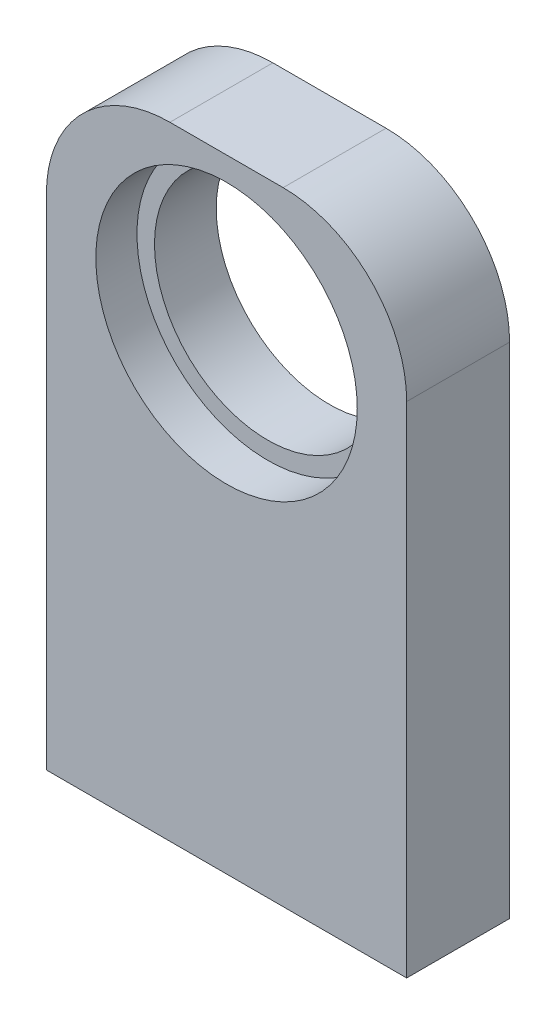
ISO-10303-21;
HEADER;
FILE_DESCRIPTION(('STEP AP214'),'2;1');
FILE_NAME('part.step','',(''),(''),'','','');
FILE_SCHEMA(('AUTOMOTIVE_DESIGN { 1 0 10303 214 1 1 1 1 }'));
ENDSEC;
DATA;
#1=APPLICATION_CONTEXT('core data for automotive mechanical design processes');
#2=APPLICATION_PROTOCOL_DEFINITION('international standard','automotive_design',2000,#1);
#3=PRODUCT_CONTEXT('',#1,'mechanical');
#4=PRODUCT('Part','Part','',(#3));
#5=PRODUCT_RELATED_PRODUCT_CATEGORY('part','',(#4));
#6=PRODUCT_DEFINITION_FORMATION('','',#4);
#7=PRODUCT_DEFINITION_CONTEXT('part definition',#1,'design');
#8=PRODUCT_DEFINITION('design','',#6,#7);
#9=PRODUCT_DEFINITION_SHAPE('','',#8);
#10=(LENGTH_UNIT() NAMED_UNIT(*) SI_UNIT(.MILLI.,.METRE.));
#11=(NAMED_UNIT(*) PLANE_ANGLE_UNIT() SI_UNIT($,.RADIAN.));
#12=(NAMED_UNIT(*) SI_UNIT($,.STERADIAN.) SOLID_ANGLE_UNIT());
#13=UNCERTAINTY_MEASURE_WITH_UNIT(LENGTH_MEASURE(1.E-05),#10,'distance_accuracy_value','');
#14=(GEOMETRIC_REPRESENTATION_CONTEXT(3) GLOBAL_UNCERTAINTY_ASSIGNED_CONTEXT((#13)) GLOBAL_UNIT_ASSIGNED_CONTEXT((#10,
#11,#12)) REPRESENTATION_CONTEXT('',''));
#15=CARTESIAN_POINT('',(0.,0.,0.));
#16=DIRECTION('',(0.,0.,1.));
#17=DIRECTION('',(1.,0.,0.));
#18=AXIS2_PLACEMENT_3D('',#15,#16,#17);
#19=CARTESIAN_POINT('',(1.16467585108376,45.5,-5.));
#20=DIRECTION('',(0.,0.,1.));
#21=DIRECTION('',(1.,0.,0.));
#22=AXIS2_PLACEMENT_3D('',#19,#20,#21);
#23=CYLINDRICAL_SURFACE('',#22,11.);
#24=CARTESIAN_POINT('',(1.16467585108376,45.5,-5.));
#25=DIRECTION('',(0.,0.,1.));
#26=DIRECTION('',(1.,0.,0.));
#27=AXIS2_PLACEMENT_3D('',#24,#25,#26);
#28=CIRCLE('',#27,11.);
#29=CARTESIAN_POINT('',(12.1646758510838,45.5,-5.));
#30=VERTEX_POINT('',#29);
#31=EDGE_CURVE('E108',#30,#30,#28,.T.);
#32=ORIENTED_EDGE('',*,*,#31,.F.);
#33=EDGE_LOOP('',(#32));
#34=FACE_BOUND('',#33,.T.);
#35=CARTESIAN_POINT('',(1.16467585108376,45.5,1.));
#36=DIRECTION('',(0.,0.,1.));
#37=DIRECTION('',(1.,0.,0.));
#38=AXIS2_PLACEMENT_3D('',#35,#36,#37);
#39=CIRCLE('',#38,11.);
#40=CARTESIAN_POINT('',(12.1646758510838,45.5,1.));
#41=VERTEX_POINT('',#40);
#42=EDGE_CURVE('E37',#41,#41,#39,.F.);
#43=ORIENTED_EDGE('',*,*,#42,.F.);
#44=EDGE_LOOP('',(#43));
#45=FACE_BOUND('',#44,.T.);
#46=ADVANCED_FACE('F33',(#34,#45),#23,.F.);
#47=CARTESIAN_POINT('',(-16.3353241489162,60.5,-5.));
#48=DIRECTION('',(1.,0.,0.));
#49=DIRECTION('',(0.,0.,-1.));
#50=AXIS2_PLACEMENT_3D('',#47,#48,#49);
#51=PLANE('',#50);
#52=DIRECTION('',(0.,-1.,0.));
#53=VECTOR('',#52,1.);
#54=CARTESIAN_POINT('',(-16.3353241489162,60.5,5.));
#55=LINE('',#54,#53);
#56=CARTESIAN_POINT('',(-16.3353241489162,48.5,5.));
#57=VERTEX_POINT('',#56);
#58=CARTESIAN_POINT('',(-16.3353241489162,0.,5.));
#59=VERTEX_POINT('',#58);
#60=EDGE_CURVE('E85',#57,#59,#55,.T.);
#61=ORIENTED_EDGE('',*,*,#60,.F.);
#62=DIRECTION('',(0.,0.,1.));
#63=VECTOR('',#62,1.);
#64=CARTESIAN_POINT('',(-16.3353241489162,48.5,-5.));
#65=LINE('',#64,#63);
#66=CARTESIAN_POINT('',(-16.3353241489162,48.5,-5.));
#67=VERTEX_POINT('',#66);
#68=EDGE_CURVE('E11',#57,#67,#65,.F.);
#69=ORIENTED_EDGE('',*,*,#68,.T.);
#70=DIRECTION('',(0.,-1.,0.));
#71=VECTOR('',#70,1.);
#72=CARTESIAN_POINT('',(-16.3353241489162,60.5,-5.));
#73=LINE('',#72,#71);
#74=CARTESIAN_POINT('',(-16.3353241489162,0.,-5.));
#75=VERTEX_POINT('',#74);
#76=EDGE_CURVE('E106',#67,#75,#73,.T.);
#77=ORIENTED_EDGE('',*,*,#76,.T.);
#78=DIRECTION('',(0.,0.,1.));
#79=VECTOR('',#78,1.);
#80=CARTESIAN_POINT('',(-16.3353241489162,0.,-5.));
#81=LINE('',#80,#79);
#82=EDGE_CURVE('E100',#75,#59,#81,.T.);
#83=ORIENTED_EDGE('',*,*,#82,.T.);
#84=EDGE_LOOP('',(#61,#69,#77,#83));
#85=FACE_BOUND('',#84,.T.);
#86=ADVANCED_FACE('F104',(#85),#51,.F.);
#87=CARTESIAN_POINT('',(-16.3353241489162,60.5,5.));
#88=DIRECTION('',(0.,0.,-1.));
#89=DIRECTION('',(-1.,0.,0.));
#90=AXIS2_PLACEMENT_3D('',#87,#88,#89);
#91=PLANE('',#90);
#92=CARTESIAN_POINT('',(1.16467585108376,45.5,5.));
#93=DIRECTION('',(0.,0.,1.));
#94=DIRECTION('',(1.,0.,0.));
#95=AXIS2_PLACEMENT_3D('',#92,#93,#94);
#96=CIRCLE('',#95,12.7);
#97=CARTESIAN_POINT('',(13.8646758510838,45.5,5.));
#98=VERTEX_POINT('',#97);
#99=EDGE_CURVE('E190',#98,#98,#96,.T.);
#100=ORIENTED_EDGE('',*,*,#99,.F.);
#101=EDGE_LOOP('',(#100));
#102=FACE_BOUND('',#101,.T.);
#103=DIRECTION('',(0.,-1.,0.));
#104=VECTOR('',#103,1.);
#105=CARTESIAN_POINT('',(18.6646758510838,60.5,5.));
#106=LINE('',#105,#104);
#107=CARTESIAN_POINT('',(18.6646758510838,48.5,5.));
#108=VERTEX_POINT('',#107);
#109=CARTESIAN_POINT('',(18.6646758510838,0.,5.));
#110=VERTEX_POINT('',#109);
#111=EDGE_CURVE('E94',#108,#110,#106,.T.);
#112=ORIENTED_EDGE('',*,*,#111,.F.);
#113=CARTESIAN_POINT('',(6.66467585108376,48.5,5.));
#114=DIRECTION('',(0.,0.,-1.));
#115=DIRECTION('',(-1.,0.,0.));
#116=AXIS2_PLACEMENT_3D('',#113,#114,#115);
#117=CIRCLE('',#116,12.);
#118=CARTESIAN_POINT('',(6.66467585108376,60.5,5.));
#119=VERTEX_POINT('',#118);
#120=EDGE_CURVE('E42',#108,#119,#117,.F.);
#121=ORIENTED_EDGE('',*,*,#120,.T.);
#122=DIRECTION('',(1.,0.,0.));
#123=VECTOR('',#122,1.);
#124=CARTESIAN_POINT('',(-16.3353241489162,60.5,5.));
#125=LINE('',#124,#123);
#126=CARTESIAN_POINT('',(-4.33532414891625,60.5,5.));
#127=VERTEX_POINT('',#126);
#128=EDGE_CURVE('E120',#127,#119,#125,.T.);
#129=ORIENTED_EDGE('',*,*,#128,.F.);
#130=CARTESIAN_POINT('',(-4.33532414891625,48.5,5.));
#131=DIRECTION('',(0.,0.,-1.));
#132=DIRECTION('',(-1.,0.,0.));
#133=AXIS2_PLACEMENT_3D('',#130,#131,#132);
#134=CIRCLE('',#133,12.);
#135=EDGE_CURVE('E49',#127,#57,#134,.F.);
#136=ORIENTED_EDGE('',*,*,#135,.T.);
#137=ORIENTED_EDGE('',*,*,#60,.T.);
#138=DIRECTION('',(1.,0.,0.));
#139=VECTOR('',#138,1.);
#140=CARTESIAN_POINT('',(-16.3353241489162,0.,5.));
#141=LINE('',#140,#139);
#142=EDGE_CURVE('E88',#59,#110,#141,.T.);
#143=ORIENTED_EDGE('',*,*,#142,.T.);
#144=EDGE_LOOP('',(#112,#121,#129,#136,#137,#143));
#145=FACE_BOUND('',#144,.T.);
#146=ADVANCED_FACE('F87',(#102,#145),#91,.F.);
#147=CARTESIAN_POINT('',(18.6646758510838,60.5,-5.));
#148=DIRECTION('',(-1.,0.,0.));
#149=DIRECTION('',(0.,0.,1.));
#150=AXIS2_PLACEMENT_3D('',#147,#148,#149);
#151=PLANE('',#150);
#152=DIRECTION('',(0.,-1.,0.));
#153=VECTOR('',#152,1.);
#154=CARTESIAN_POINT('',(18.6646758510838,60.5,-5.));
#155=LINE('',#154,#153);
#156=CARTESIAN_POINT('',(18.6646758510838,48.5,-5.));
#157=VERTEX_POINT('',#156);
#158=CARTESIAN_POINT('',(18.6646758510838,0.,-5.));
#159=VERTEX_POINT('',#158);
#160=EDGE_CURVE('E122',#157,#159,#155,.T.);
#161=ORIENTED_EDGE('',*,*,#160,.F.);
#162=DIRECTION('',(0.,0.,-1.));
#163=VECTOR('',#162,1.);
#164=CARTESIAN_POINT('',(18.6646758510838,48.5,5.));
#165=LINE('',#164,#163);
#166=EDGE_CURVE('E57',#157,#108,#165,.F.);
#167=ORIENTED_EDGE('',*,*,#166,.T.);
#168=ORIENTED_EDGE('',*,*,#111,.T.);
#169=DIRECTION('',(0.,0.,-1.));
#170=VECTOR('',#169,1.);
#171=CARTESIAN_POINT('',(18.6646758510838,0.,-5.));
#172=LINE('',#171,#170);
#173=EDGE_CURVE('E102',#110,#159,#172,.T.);
#174=ORIENTED_EDGE('',*,*,#173,.T.);
#175=EDGE_LOOP('',(#161,#167,#168,#174));
#176=FACE_BOUND('',#175,.T.);
#177=ADVANCED_FACE('F148',(#176),#151,.F.);
#178=CARTESIAN_POINT('',(-16.3353241489162,60.5,-5.));
#179=DIRECTION('',(0.,0.,1.));
#180=DIRECTION('',(1.,0.,0.));
#181=AXIS2_PLACEMENT_3D('',#178,#179,#180);
#182=PLANE('',#181);
#183=ORIENTED_EDGE('',*,*,#31,.T.);
#184=EDGE_LOOP('',(#183));
#185=FACE_BOUND('',#184,.T.);
#186=DIRECTION('',(-1.,0.,0.));
#187=VECTOR('',#186,1.);
#188=CARTESIAN_POINT('',(-16.3353241489162,60.5,-5.));
#189=LINE('',#188,#187);
#190=CARTESIAN_POINT('',(6.66467585108376,60.5,-5.));
#191=VERTEX_POINT('',#190);
#192=CARTESIAN_POINT('',(-4.33532414891625,60.5,-5.));
#193=VERTEX_POINT('',#192);
#194=EDGE_CURVE('E114',#191,#193,#189,.T.);
#195=ORIENTED_EDGE('',*,*,#194,.F.);
#196=CARTESIAN_POINT('',(6.66467585108376,48.5,-5.));
#197=DIRECTION('',(0.,0.,1.));
#198=DIRECTION('',(1.,0.,0.));
#199=AXIS2_PLACEMENT_3D('',#196,#197,#198);
#200=CIRCLE('',#199,12.);
#201=EDGE_CURVE('E132',#191,#157,#200,.F.);
#202=ORIENTED_EDGE('',*,*,#201,.T.);
#203=ORIENTED_EDGE('',*,*,#160,.T.);
#204=DIRECTION('',(-1.,0.,0.));
#205=VECTOR('',#204,1.);
#206=CARTESIAN_POINT('',(-16.3353241489162,0.,-5.));
#207=LINE('',#206,#205);
#208=EDGE_CURVE('E118',#159,#75,#207,.T.);
#209=ORIENTED_EDGE('',*,*,#208,.T.);
#210=ORIENTED_EDGE('',*,*,#76,.F.);
#211=CARTESIAN_POINT('',(-4.33532414891625,48.5,-5.));
#212=DIRECTION('',(0.,0.,1.));
#213=DIRECTION('',(1.,0.,0.));
#214=AXIS2_PLACEMENT_3D('',#211,#212,#213);
#215=CIRCLE('',#214,12.);
#216=EDGE_CURVE('E130',#67,#193,#215,.F.);
#217=ORIENTED_EDGE('',*,*,#216,.T.);
#218=EDGE_LOOP('',(#195,#202,#203,#209,#210,#217));
#219=FACE_BOUND('',#218,.T.);
#220=ADVANCED_FACE('F147',(#185,#219),#182,.F.);
#221=CARTESIAN_POINT('',(0.,60.5,0.));
#222=DIRECTION('',(0.,1.,0.));
#223=DIRECTION('',(0.,0.,1.));
#224=AXIS2_PLACEMENT_3D('',#221,#222,#223);
#225=PLANE('',#224);
#226=ORIENTED_EDGE('',*,*,#128,.T.);
#227=DIRECTION('',(0.,0.,-1.));
#228=VECTOR('',#227,1.);
#229=CARTESIAN_POINT('',(6.66467585108376,60.5,-5.));
#230=LINE('',#229,#228);
#231=EDGE_CURVE('E127',#119,#191,#230,.T.);
#232=ORIENTED_EDGE('',*,*,#231,.T.);
#233=ORIENTED_EDGE('',*,*,#194,.T.);
#234=DIRECTION('',(0.,0.,1.));
#235=VECTOR('',#234,1.);
#236=CARTESIAN_POINT('',(-4.33532414891625,60.5,5.));
#237=LINE('',#236,#235);
#238=EDGE_CURVE('E93',#193,#127,#237,.T.);
#239=ORIENTED_EDGE('',*,*,#238,.T.);
#240=EDGE_LOOP('',(#226,#232,#233,#239));
#241=FACE_BOUND('',#240,.T.);
#242=ADVANCED_FACE('F141',(#241),#225,.T.);
#243=CARTESIAN_POINT('',(0.,0.,0.));
#244=DIRECTION('',(0.,1.,0.));
#245=DIRECTION('',(0.,0.,1.));
#246=AXIS2_PLACEMENT_3D('',#243,#244,#245);
#247=PLANE('',#246);
#248=CARTESIAN_POINT('',(10.6646758510838,0.,0.));
#249=DIRECTION('',(0.,-1.,0.));
#250=DIRECTION('',(0.,0.,-1.));
#251=AXIS2_PLACEMENT_3D('',#248,#249,#250);
#252=CIRCLE('',#251,1.75);
#253=CARTESIAN_POINT('',(10.6646758510838,0.,-1.75));
#254=VERTEX_POINT('',#253);
#255=EDGE_CURVE('E201',#254,#254,#252,.T.);
#256=ORIENTED_EDGE('',*,*,#255,.F.);
#257=EDGE_LOOP('',(#256));
#258=FACE_BOUND('',#257,.T.);
#259=CARTESIAN_POINT('',(-8.33532414891625,0.,0.));
#260=DIRECTION('',(0.,-1.,0.));
#261=DIRECTION('',(0.,0.,-1.));
#262=AXIS2_PLACEMENT_3D('',#259,#260,#261);
#263=CIRCLE('',#262,1.75);
#264=CARTESIAN_POINT('',(-8.33532414891625,0.,-1.75));
#265=VERTEX_POINT('',#264);
#266=EDGE_CURVE('E200',#265,#265,#263,.T.);
#267=ORIENTED_EDGE('',*,*,#266,.F.);
#268=EDGE_LOOP('',(#267));
#269=FACE_BOUND('',#268,.T.);
#270=ORIENTED_EDGE('',*,*,#82,.F.);
#271=ORIENTED_EDGE('',*,*,#208,.F.);
#272=ORIENTED_EDGE('',*,*,#173,.F.);
#273=ORIENTED_EDGE('',*,*,#142,.F.);
#274=EDGE_LOOP('',(#270,#271,#272,#273));
#275=FACE_BOUND('',#274,.T.);
#276=ADVANCED_FACE('F98',(#258,#269,#275),#247,.F.);
#277=CARTESIAN_POINT('',(-8.33532414891625,10.,0.));
#278=DIRECTION('',(0.,-1.,0.));
#279=DIRECTION('',(0.,0.,-1.));
#280=AXIS2_PLACEMENT_3D('',#277,#278,#279);
#281=CYLINDRICAL_SURFACE('',#280,1.75);
#282=CARTESIAN_POINT('',(-8.33532414891625,10.,0.));
#283=DIRECTION('',(0.,-1.,0.));
#284=DIRECTION('',(0.,0.,-1.));
#285=AXIS2_PLACEMENT_3D('',#282,#283,#284);
#286=CIRCLE('',#285,1.75);
#287=CARTESIAN_POINT('',(-8.33532414891625,10.,-1.75));
#288=VERTEX_POINT('',#287);
#289=EDGE_CURVE('E111',#288,#288,#286,.T.);
#290=ORIENTED_EDGE('',*,*,#289,.F.);
#291=EDGE_LOOP('',(#290));
#292=FACE_BOUND('',#291,.T.);
#293=ORIENTED_EDGE('',*,*,#266,.T.);
#294=EDGE_LOOP('',(#293));
#295=FACE_BOUND('',#294,.T.);
#296=ADVANCED_FACE('F172',(#292,#295),#281,.F.);
#297=CARTESIAN_POINT('',(-8.33532414891625,10.,0.));
#298=DIRECTION('',(0.,-1.,0.));
#299=DIRECTION('',(0.,0.,-1.));
#300=AXIS2_PLACEMENT_3D('',#297,#298,#299);
#301=PLANE('',#300);
#302=ORIENTED_EDGE('',*,*,#289,.T.);
#303=EDGE_LOOP('',(#302));
#304=FACE_BOUND('',#303,.T.);
#305=ADVANCED_FACE('F211',(#304),#301,.T.);
#306=CARTESIAN_POINT('',(10.6646758510838,10.,0.));
#307=DIRECTION('',(0.,-1.,0.));
#308=DIRECTION('',(0.,0.,-1.));
#309=AXIS2_PLACEMENT_3D('',#306,#307,#308);
#310=CYLINDRICAL_SURFACE('',#309,1.75);
#311=CARTESIAN_POINT('',(10.6646758510838,10.,0.));
#312=DIRECTION('',(0.,-1.,0.));
#313=DIRECTION('',(0.,0.,-1.));
#314=AXIS2_PLACEMENT_3D('',#311,#312,#313);
#315=CIRCLE('',#314,1.75);
#316=CARTESIAN_POINT('',(10.6646758510838,10.,-1.75));
#317=VERTEX_POINT('',#316);
#318=EDGE_CURVE('E197',#317,#317,#315,.T.);
#319=ORIENTED_EDGE('',*,*,#318,.F.);
#320=EDGE_LOOP('',(#319));
#321=FACE_BOUND('',#320,.T.);
#322=ORIENTED_EDGE('',*,*,#255,.T.);
#323=EDGE_LOOP('',(#322));
#324=FACE_BOUND('',#323,.T.);
#325=ADVANCED_FACE('F216',(#321,#324),#310,.F.);
#326=CARTESIAN_POINT('',(10.6646758510838,10.,0.));
#327=DIRECTION('',(0.,-1.,0.));
#328=DIRECTION('',(0.,0.,-1.));
#329=AXIS2_PLACEMENT_3D('',#326,#327,#328);
#330=PLANE('',#329);
#331=ORIENTED_EDGE('',*,*,#318,.T.);
#332=EDGE_LOOP('',(#331));
#333=FACE_BOUND('',#332,.T.);
#334=ADVANCED_FACE('F160',(#333),#330,.T.);
#335=CARTESIAN_POINT('',(6.66467585108376,48.5,0.));
#336=DIRECTION('',(0.,0.,1.));
#337=DIRECTION('',(1.,0.,0.));
#338=AXIS2_PLACEMENT_3D('',#335,#336,#337);
#339=CYLINDRICAL_SURFACE('',#338,12.);
#340=ORIENTED_EDGE('',*,*,#120,.F.);
#341=ORIENTED_EDGE('',*,*,#166,.F.);
#342=ORIENTED_EDGE('',*,*,#201,.F.);
#343=ORIENTED_EDGE('',*,*,#231,.F.);
#344=EDGE_LOOP('',(#340,#341,#342,#343));
#345=FACE_BOUND('',#344,.T.);
#346=ADVANCED_FACE('F145',(#345),#339,.T.);
#347=CARTESIAN_POINT('',(-4.33532414891625,48.5,0.));
#348=DIRECTION('',(0.,0.,-1.));
#349=DIRECTION('',(-1.,0.,0.));
#350=AXIS2_PLACEMENT_3D('',#347,#348,#349);
#351=CYLINDRICAL_SURFACE('',#350,12.);
#352=ORIENTED_EDGE('',*,*,#216,.F.);
#353=ORIENTED_EDGE('',*,*,#68,.F.);
#354=ORIENTED_EDGE('',*,*,#135,.F.);
#355=ORIENTED_EDGE('',*,*,#238,.F.);
#356=EDGE_LOOP('',(#352,#353,#354,#355));
#357=FACE_BOUND('',#356,.T.);
#358=ADVANCED_FACE('F35',(#357),#351,.T.);
#359=CARTESIAN_POINT('',(1.16467585108376,45.5,1.));
#360=DIRECTION('',(0.,0.,1.));
#361=DIRECTION('',(1.,0.,0.));
#362=AXIS2_PLACEMENT_3D('',#359,#360,#361);
#363=PLANE('',#362);
#364=CARTESIAN_POINT('',(1.16467585108376,45.5,1.));
#365=DIRECTION('',(0.,0.,1.));
#366=DIRECTION('',(1.,0.,0.));
#367=AXIS2_PLACEMENT_3D('',#364,#365,#366);
#368=CIRCLE('',#367,12.7);
#369=CARTESIAN_POINT('',(13.8646758510838,45.5,1.));
#370=VERTEX_POINT('',#369);
#371=EDGE_CURVE('E192',#370,#370,#368,.T.);
#372=ORIENTED_EDGE('',*,*,#371,.T.);
#373=EDGE_LOOP('',(#372));
#374=FACE_BOUND('',#373,.T.);
#375=ORIENTED_EDGE('',*,*,#42,.T.);
#376=EDGE_LOOP('',(#375));
#377=FACE_BOUND('',#376,.T.);
#378=ADVANCED_FACE('F152',(#374,#377),#363,.T.);
#379=CARTESIAN_POINT('',(1.16467585108376,45.5,1.));
#380=DIRECTION('',(0.,0.,1.));
#381=DIRECTION('',(1.,0.,0.));
#382=AXIS2_PLACEMENT_3D('',#379,#380,#381);
#383=CYLINDRICAL_SURFACE('',#382,12.7);
#384=ORIENTED_EDGE('',*,*,#371,.F.);
#385=EDGE_LOOP('',(#384));
#386=FACE_BOUND('',#385,.T.);
#387=ORIENTED_EDGE('',*,*,#99,.T.);
#388=EDGE_LOOP('',(#387));
#389=FACE_BOUND('',#388,.T.);
#390=ADVANCED_FACE('F157',(#386,#389),#383,.F.);
#391=CLOSED_SHELL('',(#46,#86,#146,#177,#220,#242,#276,#296,#305,#325,#334,#346,#358,#378,#390));
#392=MANIFOLD_SOLID_BREP('B2',#391);
#393=ADVANCED_BREP_SHAPE_REPRESENTATION('',(#18,#392),#14);
#394=SHAPE_DEFINITION_REPRESENTATION(#9,#393);
ENDSEC;
END-ISO-10303-21;
